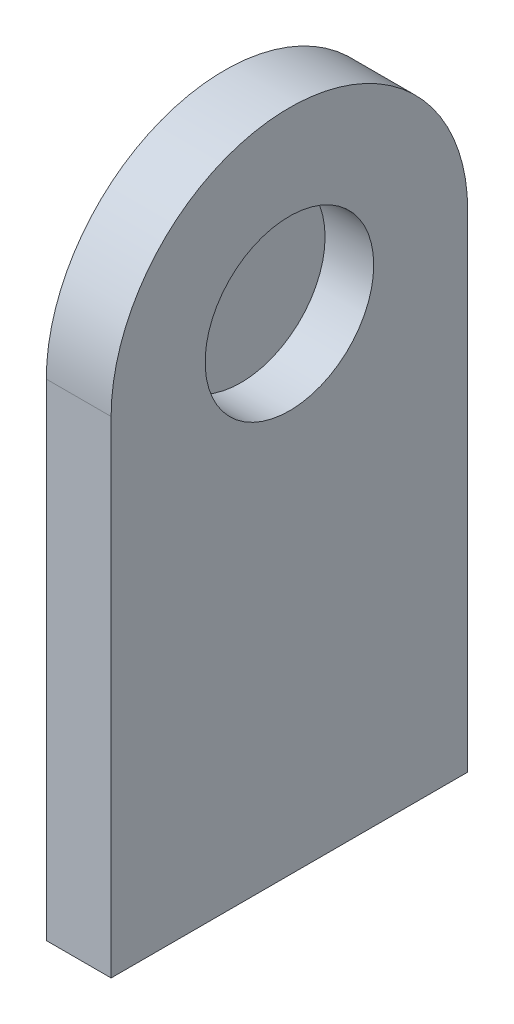
ISO-10303-21;
HEADER;
FILE_DESCRIPTION(('STEP AP214'),'2;1');
FILE_NAME('part.step','',(''),(''),'','','');
FILE_SCHEMA(('AUTOMOTIVE_DESIGN { 1 0 10303 214 1 1 1 1 }'));
ENDSEC;
DATA;
#1=APPLICATION_CONTEXT('core data for automotive mechanical design processes');
#2=APPLICATION_PROTOCOL_DEFINITION('international standard','automotive_design',2000,#1);
#3=PRODUCT_CONTEXT('',#1,'mechanical');
#4=PRODUCT('Part','Part','',(#3));
#5=PRODUCT_RELATED_PRODUCT_CATEGORY('part','',(#4));
#6=PRODUCT_DEFINITION_FORMATION('','',#4);
#7=PRODUCT_DEFINITION_CONTEXT('part definition',#1,'design');
#8=PRODUCT_DEFINITION('design','',#6,#7);
#9=PRODUCT_DEFINITION_SHAPE('','',#8);
#10=(LENGTH_UNIT() NAMED_UNIT(*) SI_UNIT(.MILLI.,.METRE.));
#11=(NAMED_UNIT(*) PLANE_ANGLE_UNIT() SI_UNIT($,.RADIAN.));
#12=(NAMED_UNIT(*) SI_UNIT($,.STERADIAN.) SOLID_ANGLE_UNIT());
#13=UNCERTAINTY_MEASURE_WITH_UNIT(LENGTH_MEASURE(1.E-05),#10,'distance_accuracy_value','');
#14=(GEOMETRIC_REPRESENTATION_CONTEXT(3) GLOBAL_UNCERTAINTY_ASSIGNED_CONTEXT((#13)) GLOBAL_UNIT_ASSIGNED_CONTEXT((#10,
#11,#12)) REPRESENTATION_CONTEXT('',''));
#15=CARTESIAN_POINT('',(0.,0.,0.));
#16=DIRECTION('',(0.,0.,1.));
#17=DIRECTION('',(1.,0.,0.));
#18=AXIS2_PLACEMENT_3D('',#15,#16,#17);
#19=CARTESIAN_POINT('',(20.,0.,-55.));
#20=DIRECTION('',(0.,0.,-1.));
#21=DIRECTION('',(0.,1.,0.));
#22=AXIS2_PLACEMENT_3D('',#19,#20,#21);
#23=PLANE('',#22);
#24=DIRECTION('',(0.,-1.,0.));
#25=VECTOR('',#24,1.);
#26=CARTESIAN_POINT('',(0.,0.,-55.));
#27=LINE('',#26,#25);
#28=CARTESIAN_POINT('',(0.,75.,-55.));
#29=VERTEX_POINT('',#28);
#30=CARTESIAN_POINT('',(0.,-75.,-55.));
#31=VERTEX_POINT('',#30);
#32=EDGE_CURVE('E154',#29,#31,#27,.T.);
#33=ORIENTED_EDGE('',*,*,#32,.F.);
#34=DIRECTION('',(-1.,0.,0.));
#35=VECTOR('',#34,1.);
#36=CARTESIAN_POINT('',(20.,75.,-55.));
#37=LINE('',#36,#35);
#38=CARTESIAN_POINT('',(20.,75.,-55.));
#39=VERTEX_POINT('',#38);
#40=EDGE_CURVE('E11',#39,#29,#37,.T.);
#41=ORIENTED_EDGE('',*,*,#40,.F.);
#42=DIRECTION('',(0.,-1.,0.));
#43=VECTOR('',#42,1.);
#44=CARTESIAN_POINT('',(20.,0.,-55.));
#45=LINE('',#44,#43);
#46=CARTESIAN_POINT('',(20.,-75.,-55.));
#47=VERTEX_POINT('',#46);
#48=EDGE_CURVE('E158',#39,#47,#45,.T.);
#49=ORIENTED_EDGE('',*,*,#48,.T.);
#50=DIRECTION('',(-1.,0.,0.));
#51=VECTOR('',#50,1.);
#52=CARTESIAN_POINT('',(20.,-75.,-55.));
#53=LINE('',#52,#51);
#54=EDGE_CURVE('E60',#47,#31,#53,.T.);
#55=ORIENTED_EDGE('',*,*,#54,.T.);
#56=EDGE_LOOP('',(#33,#41,#49,#55));
#57=FACE_BOUND('',#56,.T.);
#58=ADVANCED_FACE('F43',(#57),#23,.T.);
#59=CARTESIAN_POINT('',(20.,75.,0.));
#60=DIRECTION('',(-1.,0.,0.));
#61=DIRECTION('',(0.,0.,1.));
#62=AXIS2_PLACEMENT_3D('',#59,#60,#61);
#63=CYLINDRICAL_SURFACE('',#62,55.);
#64=CARTESIAN_POINT('',(0.,75.,0.));
#65=DIRECTION('',(1.,0.,0.));
#66=DIRECTION('',(0.,0.,-1.));
#67=AXIS2_PLACEMENT_3D('',#64,#65,#66);
#68=CIRCLE('',#67,55.);
#69=CARTESIAN_POINT('',(0.,75.,55.));
#70=VERTEX_POINT('',#69);
#71=EDGE_CURVE('E173',#29,#70,#68,.T.);
#72=ORIENTED_EDGE('',*,*,#71,.T.);
#73=DIRECTION('',(-1.,0.,0.));
#74=VECTOR('',#73,1.);
#75=CARTESIAN_POINT('',(20.,75.,55.));
#76=LINE('',#75,#74);
#77=CARTESIAN_POINT('',(20.,75.,55.));
#78=VERTEX_POINT('',#77);
#79=EDGE_CURVE('E52',#78,#70,#76,.T.);
#80=ORIENTED_EDGE('',*,*,#79,.F.);
#81=CARTESIAN_POINT('',(20.,75.,0.));
#82=DIRECTION('',(1.,0.,0.));
#83=DIRECTION('',(0.,0.,-1.));
#84=AXIS2_PLACEMENT_3D('',#81,#82,#83);
#85=CIRCLE('',#84,55.);
#86=EDGE_CURVE('E161',#39,#78,#85,.T.);
#87=ORIENTED_EDGE('',*,*,#86,.F.);
#88=ORIENTED_EDGE('',*,*,#40,.T.);
#89=EDGE_LOOP('',(#72,#80,#87,#88));
#90=FACE_BOUND('',#89,.T.);
#91=ADVANCED_FACE('F207',(#90),#63,.T.);
#92=CARTESIAN_POINT('',(20.,0.,55.));
#93=DIRECTION('',(0.,0.,-1.));
#94=DIRECTION('',(0.,1.,0.));
#95=AXIS2_PLACEMENT_3D('',#92,#93,#94);
#96=PLANE('',#95);
#97=DIRECTION('',(0.,-1.,0.));
#98=VECTOR('',#97,1.);
#99=CARTESIAN_POINT('',(0.,0.,55.));
#100=LINE('',#99,#98);
#101=CARTESIAN_POINT('',(0.,-75.,55.));
#102=VERTEX_POINT('',#101);
#103=EDGE_CURVE('E176',#70,#102,#100,.T.);
#104=ORIENTED_EDGE('',*,*,#103,.T.);
#105=DIRECTION('',(-1.,0.,0.));
#106=VECTOR('',#105,1.);
#107=CARTESIAN_POINT('',(20.,-75.,55.));
#108=LINE('',#107,#106);
#109=CARTESIAN_POINT('',(20.,-75.,55.));
#110=VERTEX_POINT('',#109);
#111=EDGE_CURVE('E75',#110,#102,#108,.T.);
#112=ORIENTED_EDGE('',*,*,#111,.F.);
#113=DIRECTION('',(0.,-1.,0.));
#114=VECTOR('',#113,1.);
#115=CARTESIAN_POINT('',(20.,0.,55.));
#116=LINE('',#115,#114);
#117=EDGE_CURVE('E165',#78,#110,#116,.T.);
#118=ORIENTED_EDGE('',*,*,#117,.F.);
#119=ORIENTED_EDGE('',*,*,#79,.T.);
#120=EDGE_LOOP('',(#104,#112,#118,#119));
#121=FACE_BOUND('',#120,.T.);
#122=ADVANCED_FACE('F191',(#121),#96,.F.);
#123=CARTESIAN_POINT('',(20.,-75.,0.));
#124=DIRECTION('',(0.,-1.,0.));
#125=DIRECTION('',(0.,0.,-1.));
#126=AXIS2_PLACEMENT_3D('',#123,#124,#125);
#127=PLANE('',#126);
#128=CARTESIAN_POINT('',(10.,-75.,36.6666666666666));
#129=DIRECTION('',(0.,-1.,0.));
#130=DIRECTION('',(0.,0.,-1.));
#131=AXIS2_PLACEMENT_3D('',#128,#129,#130);
#132=CIRCLE('',#131,2.49999999999999);
#133=CARTESIAN_POINT('',(10.,-75.,34.1666666666667));
#134=VERTEX_POINT('',#133);
#135=EDGE_CURVE('E112',#134,#134,#132,.T.);
#136=ORIENTED_EDGE('',*,*,#135,.F.);
#137=EDGE_LOOP('',(#136));
#138=FACE_BOUND('',#137,.T.);
#139=CARTESIAN_POINT('',(10.,-75.,18.3333333333333));
#140=DIRECTION('',(0.,-1.,0.));
#141=DIRECTION('',(0.,0.,-1.));
#142=AXIS2_PLACEMENT_3D('',#139,#140,#141);
#143=CIRCLE('',#142,2.49999999999999);
#144=CARTESIAN_POINT('',(10.,-75.,15.8333333333333));
#145=VERTEX_POINT('',#144);
#146=EDGE_CURVE('E111',#145,#145,#143,.T.);
#147=ORIENTED_EDGE('',*,*,#146,.F.);
#148=EDGE_LOOP('',(#147));
#149=FACE_BOUND('',#148,.T.);
#150=CARTESIAN_POINT('',(10.,-75.,0.));
#151=DIRECTION('',(0.,-1.,0.));
#152=DIRECTION('',(0.,0.,-1.));
#153=AXIS2_PLACEMENT_3D('',#150,#151,#152);
#154=CIRCLE('',#153,2.49999999999999);
#155=CARTESIAN_POINT('',(10.,-75.,-2.50000000000001));
#156=VERTEX_POINT('',#155);
#157=EDGE_CURVE('E125',#156,#156,#154,.T.);
#158=ORIENTED_EDGE('',*,*,#157,.F.);
#159=EDGE_LOOP('',(#158));
#160=FACE_BOUND('',#159,.T.);
#161=CARTESIAN_POINT('',(10.,-75.,-18.3333333333334));
#162=DIRECTION('',(0.,-1.,0.));
#163=DIRECTION('',(0.,0.,-1.));
#164=AXIS2_PLACEMENT_3D('',#161,#162,#163);
#165=CIRCLE('',#164,2.49999999999999);
#166=CARTESIAN_POINT('',(10.,-75.,-20.8333333333333));
#167=VERTEX_POINT('',#166);
#168=EDGE_CURVE('E133',#167,#167,#165,.T.);
#169=ORIENTED_EDGE('',*,*,#168,.F.);
#170=EDGE_LOOP('',(#169));
#171=FACE_BOUND('',#170,.T.);
#172=CARTESIAN_POINT('',(10.,-75.,-36.6666666666667));
#173=DIRECTION('',(0.,-1.,0.));
#174=DIRECTION('',(0.,0.,-1.));
#175=AXIS2_PLACEMENT_3D('',#172,#173,#174);
#176=CIRCLE('',#175,2.49999999999999);
#177=CARTESIAN_POINT('',(10.,-75.,-39.1666666666667));
#178=VERTEX_POINT('',#177);
#179=EDGE_CURVE('E141',#178,#178,#176,.T.);
#180=ORIENTED_EDGE('',*,*,#179,.F.);
#181=EDGE_LOOP('',(#180));
#182=FACE_BOUND('',#181,.T.);
#183=DIRECTION('',(0.,0.,1.));
#184=VECTOR('',#183,1.);
#185=CARTESIAN_POINT('',(0.,-75.,0.));
#186=LINE('',#185,#184);
#187=EDGE_CURVE('E162',#31,#102,#186,.T.);
#188=ORIENTED_EDGE('',*,*,#187,.F.);
#189=ORIENTED_EDGE('',*,*,#54,.F.);
#190=DIRECTION('',(0.,0.,1.));
#191=VECTOR('',#190,1.);
#192=CARTESIAN_POINT('',(20.,-75.,0.));
#193=LINE('',#192,#191);
#194=EDGE_CURVE('E168',#47,#110,#193,.T.);
#195=ORIENTED_EDGE('',*,*,#194,.T.);
#196=ORIENTED_EDGE('',*,*,#111,.T.);
#197=EDGE_LOOP('',(#188,#189,#195,#196));
#198=FACE_BOUND('',#197,.T.);
#199=ADVANCED_FACE('F196',(#138,#149,#160,#171,#182,#198),#127,.T.);
#200=CARTESIAN_POINT('',(20.,0.,0.));
#201=DIRECTION('',(1.,0.,0.));
#202=DIRECTION('',(0.,0.,-1.));
#203=AXIS2_PLACEMENT_3D('',#200,#201,#202);
#204=PLANE('',#203);
#205=CARTESIAN_POINT('',(20.,75.,0.));
#206=DIRECTION('',(1.,0.,0.));
#207=DIRECTION('',(0.,0.,-1.));
#208=AXIS2_PLACEMENT_3D('',#205,#206,#207);
#209=CIRCLE('',#208,26.);
#210=CARTESIAN_POINT('',(20.,75.,-26.));
#211=VERTEX_POINT('',#210);
#212=EDGE_CURVE('E149',#211,#211,#209,.T.);
#213=ORIENTED_EDGE('',*,*,#212,.F.);
#214=EDGE_LOOP('',(#213));
#215=FACE_BOUND('',#214,.T.);
#216=ORIENTED_EDGE('',*,*,#48,.F.);
#217=ORIENTED_EDGE('',*,*,#86,.T.);
#218=ORIENTED_EDGE('',*,*,#117,.T.);
#219=ORIENTED_EDGE('',*,*,#194,.F.);
#220=EDGE_LOOP('',(#216,#217,#218,#219));
#221=FACE_BOUND('',#220,.T.);
#222=ADVANCED_FACE('F198',(#215,#221),#204,.T.);
#223=CARTESIAN_POINT('',(0.,0.,0.));
#224=DIRECTION('',(1.,0.,0.));
#225=DIRECTION('',(0.,0.,-1.));
#226=AXIS2_PLACEMENT_3D('',#223,#224,#225);
#227=PLANE('',#226);
#228=ORIENTED_EDGE('',*,*,#32,.T.);
#229=ORIENTED_EDGE('',*,*,#187,.T.);
#230=ORIENTED_EDGE('',*,*,#103,.F.);
#231=ORIENTED_EDGE('',*,*,#71,.F.);
#232=EDGE_LOOP('',(#228,#229,#230,#231));
#233=FACE_BOUND('',#232,.T.);
#234=ADVANCED_FACE('F195',(#233),#227,.F.);
#235=CARTESIAN_POINT('',(5.,75.,0.));
#236=DIRECTION('',(1.,0.,0.));
#237=DIRECTION('',(0.,0.,-1.));
#238=AXIS2_PLACEMENT_3D('',#235,#236,#237);
#239=CYLINDRICAL_SURFACE('',#238,26.);
#240=CARTESIAN_POINT('',(5.,75.,0.));
#241=DIRECTION('',(1.,0.,0.));
#242=DIRECTION('',(0.,0.,-1.));
#243=AXIS2_PLACEMENT_3D('',#240,#241,#242);
#244=CIRCLE('',#243,26.);
#245=CARTESIAN_POINT('',(5.,75.,-26.));
#246=VERTEX_POINT('',#245);
#247=EDGE_CURVE('E150',#246,#246,#244,.T.);
#248=ORIENTED_EDGE('',*,*,#247,.F.);
#249=EDGE_LOOP('',(#248));
#250=FACE_BOUND('',#249,.T.);
#251=ORIENTED_EDGE('',*,*,#212,.T.);
#252=EDGE_LOOP('',(#251));
#253=FACE_BOUND('',#252,.T.);
#254=ADVANCED_FACE('F235',(#250,#253),#239,.F.);
#255=CARTESIAN_POINT('',(5.,75.,0.));
#256=DIRECTION('',(1.,0.,0.));
#257=DIRECTION('',(0.,0.,-1.));
#258=AXIS2_PLACEMENT_3D('',#255,#256,#257);
#259=PLANE('',#258);
#260=ORIENTED_EDGE('',*,*,#247,.T.);
#261=EDGE_LOOP('',(#260));
#262=FACE_BOUND('',#261,.T.);
#263=ADVANCED_FACE('F251',(#262),#259,.T.);
#264=CARTESIAN_POINT('',(10.,-35.,-36.6666666666667));
#265=DIRECTION('',(0.,-1.,0.));
#266=DIRECTION('',(0.,0.,-1.));
#267=AXIS2_PLACEMENT_3D('',#264,#265,#266);
#268=CONICAL_SURFACE('',#267,2.5,1.02974425867665);
#269=CARTESIAN_POINT('',(9.99999999999999,-33.4978484524311,-36.6666666666667));
#270=VERTEX_POINT('',#269);
#271=VERTEX_LOOP('',#270);
#272=FACE_BOUND('',#271,.T.);
#273=CARTESIAN_POINT('',(10.,-35.,-36.6666666666667));
#274=DIRECTION('',(0.,-1.,0.));
#275=DIRECTION('',(0.,0.,-1.));
#276=AXIS2_PLACEMENT_3D('',#273,#274,#275);
#277=CIRCLE('',#276,2.5);
#278=CARTESIAN_POINT('',(10.,-35.,-39.1666666666667));
#279=VERTEX_POINT('',#278);
#280=EDGE_CURVE('E145',#279,#279,#277,.T.);
#281=ORIENTED_EDGE('',*,*,#280,.T.);
#282=EDGE_LOOP('',(#281));
#283=FACE_BOUND('',#282,.T.);
#284=ADVANCED_FACE('F260',(#272,#283),#268,.F.);
#285=CARTESIAN_POINT('',(10.,-75.,-36.6666666666667));
#286=DIRECTION('',(0.,-1.,0.));
#287=DIRECTION('',(0.,0.,-1.));
#288=AXIS2_PLACEMENT_3D('',#285,#286,#287);
#289=CYLINDRICAL_SURFACE('',#288,2.49999999999999);
#290=ORIENTED_EDGE('',*,*,#280,.F.);
#291=EDGE_LOOP('',(#290));
#292=FACE_BOUND('',#291,.T.);
#293=ORIENTED_EDGE('',*,*,#179,.T.);
#294=EDGE_LOOP('',(#293));
#295=FACE_BOUND('',#294,.T.);
#296=ADVANCED_FACE('F274',(#292,#295),#289,.F.);
#297=CARTESIAN_POINT('',(10.,-35.,-18.3333333333334));
#298=DIRECTION('',(0.,-1.,0.));
#299=DIRECTION('',(0.,0.,-1.));
#300=AXIS2_PLACEMENT_3D('',#297,#298,#299);
#301=CONICAL_SURFACE('',#300,2.5,1.02974425867665);
#302=CARTESIAN_POINT('',(9.99999999999999,-33.4978484524311,-18.3333333333334));
#303=VERTEX_POINT('',#302);
#304=VERTEX_LOOP('',#303);
#305=FACE_BOUND('',#304,.T.);
#306=CARTESIAN_POINT('',(10.,-35.,-18.3333333333334));
#307=DIRECTION('',(0.,-1.,0.));
#308=DIRECTION('',(0.,0.,-1.));
#309=AXIS2_PLACEMENT_3D('',#306,#307,#308);
#310=CIRCLE('',#309,2.5);
#311=CARTESIAN_POINT('',(10.,-35.,-20.8333333333333));
#312=VERTEX_POINT('',#311);
#313=EDGE_CURVE('E137',#312,#312,#310,.T.);
#314=ORIENTED_EDGE('',*,*,#313,.T.);
#315=EDGE_LOOP('',(#314));
#316=FACE_BOUND('',#315,.T.);
#317=ADVANCED_FACE('F284',(#305,#316),#301,.F.);
#318=CARTESIAN_POINT('',(10.,-75.,-18.3333333333334));
#319=DIRECTION('',(0.,-1.,0.));
#320=DIRECTION('',(0.,0.,-1.));
#321=AXIS2_PLACEMENT_3D('',#318,#319,#320);
#322=CYLINDRICAL_SURFACE('',#321,2.49999999999999);
#323=ORIENTED_EDGE('',*,*,#313,.F.);
#324=EDGE_LOOP('',(#323));
#325=FACE_BOUND('',#324,.T.);
#326=ORIENTED_EDGE('',*,*,#168,.T.);
#327=EDGE_LOOP('',(#326));
#328=FACE_BOUND('',#327,.T.);
#329=ADVANCED_FACE('F294',(#325,#328),#322,.F.);
#330=CARTESIAN_POINT('',(10.,-35.,0.));
#331=DIRECTION('',(0.,-1.,0.));
#332=DIRECTION('',(0.,0.,-1.));
#333=AXIS2_PLACEMENT_3D('',#330,#331,#332);
#334=CONICAL_SURFACE('',#333,2.5,1.02974425867665);
#335=CARTESIAN_POINT('',(9.99999999999999,-33.4978484524311,0.));
#336=VERTEX_POINT('',#335);
#337=VERTEX_LOOP('',#336);
#338=FACE_BOUND('',#337,.T.);
#339=CARTESIAN_POINT('',(10.,-35.,0.));
#340=DIRECTION('',(0.,-1.,0.));
#341=DIRECTION('',(0.,0.,-1.));
#342=AXIS2_PLACEMENT_3D('',#339,#340,#341);
#343=CIRCLE('',#342,2.5);
#344=CARTESIAN_POINT('',(10.,-35.,-2.50000000000002));
#345=VERTEX_POINT('',#344);
#346=EDGE_CURVE('E129',#345,#345,#343,.T.);
#347=ORIENTED_EDGE('',*,*,#346,.T.);
#348=EDGE_LOOP('',(#347));
#349=FACE_BOUND('',#348,.T.);
#350=ADVANCED_FACE('F304',(#338,#349),#334,.F.);
#351=CARTESIAN_POINT('',(10.,-75.,0.));
#352=DIRECTION('',(0.,-1.,0.));
#353=DIRECTION('',(0.,0.,-1.));
#354=AXIS2_PLACEMENT_3D('',#351,#352,#353);
#355=CYLINDRICAL_SURFACE('',#354,2.49999999999999);
#356=ORIENTED_EDGE('',*,*,#346,.F.);
#357=EDGE_LOOP('',(#356));
#358=FACE_BOUND('',#357,.T.);
#359=ORIENTED_EDGE('',*,*,#157,.T.);
#360=EDGE_LOOP('',(#359));
#361=FACE_BOUND('',#360,.T.);
#362=ADVANCED_FACE('F314',(#358,#361),#355,.F.);
#363=CARTESIAN_POINT('',(10.,-35.,18.3333333333333));
#364=DIRECTION('',(0.,-1.,0.));
#365=DIRECTION('',(0.,0.,-1.));
#366=AXIS2_PLACEMENT_3D('',#363,#364,#365);
#367=CONICAL_SURFACE('',#366,2.5,1.02974425867665);
#368=CARTESIAN_POINT('',(9.99999999999999,-33.4978484524311,18.3333333333333));
#369=VERTEX_POINT('',#368);
#370=VERTEX_LOOP('',#369);
#371=FACE_BOUND('',#370,.T.);
#372=CARTESIAN_POINT('',(10.,-35.,18.3333333333333));
#373=DIRECTION('',(0.,-1.,0.));
#374=DIRECTION('',(0.,0.,-1.));
#375=AXIS2_PLACEMENT_3D('',#372,#373,#374);
#376=CIRCLE('',#375,2.5);
#377=CARTESIAN_POINT('',(10.,-35.,15.8333333333333));
#378=VERTEX_POINT('',#377);
#379=EDGE_CURVE('E117',#378,#378,#376,.T.);
#380=ORIENTED_EDGE('',*,*,#379,.T.);
#381=EDGE_LOOP('',(#380));
#382=FACE_BOUND('',#381,.T.);
#383=ADVANCED_FACE('F324',(#371,#382),#367,.F.);
#384=CARTESIAN_POINT('',(10.,-75.,18.3333333333333));
#385=DIRECTION('',(0.,-1.,0.));
#386=DIRECTION('',(0.,0.,-1.));
#387=AXIS2_PLACEMENT_3D('',#384,#385,#386);
#388=CYLINDRICAL_SURFACE('',#387,2.49999999999999);
#389=ORIENTED_EDGE('',*,*,#379,.F.);
#390=EDGE_LOOP('',(#389));
#391=FACE_BOUND('',#390,.T.);
#392=ORIENTED_EDGE('',*,*,#146,.T.);
#393=EDGE_LOOP('',(#392));
#394=FACE_BOUND('',#393,.T.);
#395=ADVANCED_FACE('F104',(#391,#394),#388,.F.);
#396=CARTESIAN_POINT('',(10.,-35.,36.6666666666666));
#397=DIRECTION('',(0.,-1.,0.));
#398=DIRECTION('',(0.,0.,-1.));
#399=AXIS2_PLACEMENT_3D('',#396,#397,#398);
#400=CONICAL_SURFACE('',#399,2.5,1.02974425867665);
#401=CARTESIAN_POINT('',(9.99999999999999,-33.4978484524311,36.6666666666666));
#402=VERTEX_POINT('',#401);
#403=VERTEX_LOOP('',#402);
#404=FACE_BOUND('',#403,.T.);
#405=CARTESIAN_POINT('',(10.,-35.,36.6666666666666));
#406=DIRECTION('',(0.,-1.,0.));
#407=DIRECTION('',(0.,0.,-1.));
#408=AXIS2_PLACEMENT_3D('',#405,#406,#407);
#409=CIRCLE('',#408,2.5);
#410=CARTESIAN_POINT('',(10.,-35.,34.1666666666667));
#411=VERTEX_POINT('',#410);
#412=EDGE_CURVE('E108',#411,#411,#409,.T.);
#413=ORIENTED_EDGE('',*,*,#412,.T.);
#414=EDGE_LOOP('',(#413));
#415=FACE_BOUND('',#414,.T.);
#416=ADVANCED_FACE('F100',(#404,#415),#400,.F.);
#417=CARTESIAN_POINT('',(10.,-75.,36.6666666666666));
#418=DIRECTION('',(0.,-1.,0.));
#419=DIRECTION('',(0.,0.,-1.));
#420=AXIS2_PLACEMENT_3D('',#417,#418,#419);
#421=CYLINDRICAL_SURFACE('',#420,2.49999999999999);
#422=ORIENTED_EDGE('',*,*,#412,.F.);
#423=EDGE_LOOP('',(#422));
#424=FACE_BOUND('',#423,.T.);
#425=ORIENTED_EDGE('',*,*,#135,.T.);
#426=EDGE_LOOP('',(#425));
#427=FACE_BOUND('',#426,.T.);
#428=ADVANCED_FACE('F103',(#424,#427),#421,.F.);
#429=CLOSED_SHELL('',(#58,#91,#122,#199,#222,#234,#254,#263,#284,#296,#317,#329,#350,#362,#383,
#395,#416,#428));
#430=MANIFOLD_SOLID_BREP('B2',#429);
#431=ADVANCED_BREP_SHAPE_REPRESENTATION('',(#18,#430),#14);
#432=SHAPE_DEFINITION_REPRESENTATION(#9,#431);
ENDSEC;
END-ISO-10303-21;
